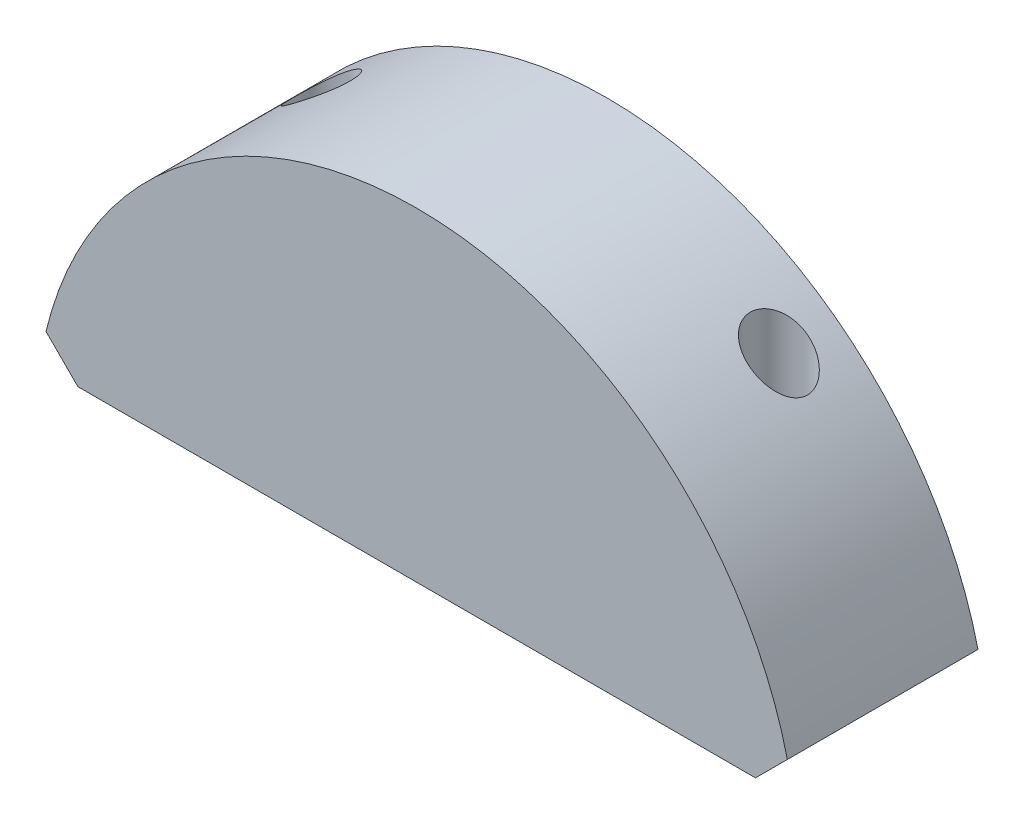
ISO-10303-21;
HEADER;
FILE_DESCRIPTION(('STEP AP214'),'2;1');
FILE_NAME('part.step','',(''),(''),'','','');
FILE_SCHEMA(('AUTOMOTIVE_DESIGN { 1 0 10303 214 1 1 1 1 }'));
ENDSEC;
DATA;
#1=APPLICATION_CONTEXT('core data for automotive mechanical design processes');
#2=APPLICATION_PROTOCOL_DEFINITION('international standard','automotive_design',2000,#1);
#3=PRODUCT_CONTEXT('',#1,'mechanical');
#4=PRODUCT('Part','Part','',(#3));
#5=PRODUCT_RELATED_PRODUCT_CATEGORY('part','',(#4));
#6=PRODUCT_DEFINITION_FORMATION('','',#4);
#7=PRODUCT_DEFINITION_CONTEXT('part definition',#1,'design');
#8=PRODUCT_DEFINITION('design','',#6,#7);
#9=PRODUCT_DEFINITION_SHAPE('','',#8);
#10=(LENGTH_UNIT() NAMED_UNIT(*) SI_UNIT(.MILLI.,.METRE.));
#11=(NAMED_UNIT(*) PLANE_ANGLE_UNIT() SI_UNIT($,.RADIAN.));
#12=(NAMED_UNIT(*) SI_UNIT($,.STERADIAN.) SOLID_ANGLE_UNIT());
#13=UNCERTAINTY_MEASURE_WITH_UNIT(LENGTH_MEASURE(1.E-05),#10,'distance_accuracy_value','');
#14=(GEOMETRIC_REPRESENTATION_CONTEXT(3) GLOBAL_UNCERTAINTY_ASSIGNED_CONTEXT((#13)) GLOBAL_UNIT_ASSIGNED_CONTEXT((#10,
#11,#12)) REPRESENTATION_CONTEXT('',''));
#15=CARTESIAN_POINT('',(0.,0.,0.));
#16=DIRECTION('',(0.,0.,1.));
#17=DIRECTION('',(1.,0.,0.));
#18=AXIS2_PLACEMENT_3D('',#15,#16,#17);
#19=CARTESIAN_POINT('',(-19.4464743814244,4.67275444813921,10.));
#20=DIRECTION('',(0.707106781186549,0.707106781186546,0.));
#21=DIRECTION('',(-0.707106781186546,0.707106781186549,0.));
#22=AXIS2_PLACEMENT_3D('',#19,#20,#21);
#23=PLANE('',#22);
#24=DIRECTION('',(0.707106781186546,-0.707106781186549,0.));
#25=VECTOR('',#24,1.);
#26=CARTESIAN_POINT('',(-19.4464743814244,4.67275444813921,0.));
#27=LINE('',#26,#25);
#28=CARTESIAN_POINT('',(-19.4464743814244,4.67275444813921,0.));
#29=VERTEX_POINT('',#28);
#30=CARTESIAN_POINT('',(-17.7737199332852,3.,0.));
#31=VERTEX_POINT('',#30);
#32=EDGE_CURVE('E101',#29,#31,#27,.T.);
#33=ORIENTED_EDGE('',*,*,#32,.T.);
#34=DIRECTION('',(0.,0.,-1.));
#35=VECTOR('',#34,1.);
#36=CARTESIAN_POINT('',(-17.7737199332852,3.,10.));
#37=LINE('',#36,#35);
#38=CARTESIAN_POINT('',(-17.7737199332852,3.,10.));
#39=VERTEX_POINT('',#38);
#40=EDGE_CURVE('E11',#39,#31,#37,.T.);
#41=ORIENTED_EDGE('',*,*,#40,.F.);
#42=DIRECTION('',(0.707106781186546,-0.707106781186549,0.));
#43=VECTOR('',#42,1.);
#44=CARTESIAN_POINT('',(-19.4464743814244,4.67275444813921,10.));
#45=LINE('',#44,#43);
#46=CARTESIAN_POINT('',(-19.4464743814244,4.67275444813921,10.));
#47=VERTEX_POINT('',#46);
#48=EDGE_CURVE('E88',#47,#39,#45,.T.);
#49=ORIENTED_EDGE('',*,*,#48,.F.);
#50=DIRECTION('',(0.,0.,-1.));
#51=VECTOR('',#50,1.);
#52=CARTESIAN_POINT('',(-19.4464743814244,4.67275444813921,10.));
#53=LINE('',#52,#51);
#54=EDGE_CURVE('E97',#47,#29,#53,.T.);
#55=ORIENTED_EDGE('',*,*,#54,.T.);
#56=EDGE_LOOP('',(#33,#41,#49,#55));
#57=FACE_BOUND('',#56,.T.);
#58=ADVANCED_FACE('F31',(#57),#23,.F.);
#59=CARTESIAN_POINT('',(17.7737199332852,3.,10.));
#60=DIRECTION('',(0.,1.,0.));
#61=DIRECTION('',(0.,0.,1.));
#62=AXIS2_PLACEMENT_3D('',#59,#60,#61);
#63=PLANE('',#62);
#64=CARTESIAN_POINT('',(12.,3.,3.));
#65=DIRECTION('',(0.,-1.,0.));
#66=DIRECTION('',(0.,0.,1.));
#67=AXIS2_PLACEMENT_3D('',#64,#65,#66);
#68=CIRCLE('',#67,1.5);
#69=CARTESIAN_POINT('',(12.,3.,4.5));
#70=VERTEX_POINT('',#69);
#71=EDGE_CURVE('E149',#70,#70,#68,.T.);
#72=ORIENTED_EDGE('',*,*,#71,.F.);
#73=EDGE_LOOP('',(#72));
#74=FACE_BOUND('',#73,.T.);
#75=CARTESIAN_POINT('',(-12.,3.,3.));
#76=DIRECTION('',(0.,-1.,0.));
#77=DIRECTION('',(0.,0.,-1.));
#78=AXIS2_PLACEMENT_3D('',#75,#76,#77);
#79=CIRCLE('',#78,1.5);
#80=CARTESIAN_POINT('',(-12.,3.,1.5));
#81=VERTEX_POINT('',#80);
#82=EDGE_CURVE('E113',#81,#81,#79,.T.);
#83=ORIENTED_EDGE('',*,*,#82,.F.);
#84=EDGE_LOOP('',(#83));
#85=FACE_BOUND('',#84,.T.);
#86=DIRECTION('',(1.,0.,0.));
#87=VECTOR('',#86,1.);
#88=CARTESIAN_POINT('',(17.7737199332852,3.,0.));
#89=LINE('',#88,#87);
#90=CARTESIAN_POINT('',(17.7737199332852,3.,0.));
#91=VERTEX_POINT('',#90);
#92=EDGE_CURVE('E92',#31,#91,#89,.T.);
#93=ORIENTED_EDGE('',*,*,#92,.T.);
#94=DIRECTION('',(0.,0.,-1.));
#95=VECTOR('',#94,1.);
#96=CARTESIAN_POINT('',(17.7737199332852,3.,10.));
#97=LINE('',#96,#95);
#98=CARTESIAN_POINT('',(17.7737199332852,3.,10.));
#99=VERTEX_POINT('',#98);
#100=EDGE_CURVE('E44',#99,#91,#97,.T.);
#101=ORIENTED_EDGE('',*,*,#100,.F.);
#102=DIRECTION('',(1.,0.,0.));
#103=VECTOR('',#102,1.);
#104=CARTESIAN_POINT('',(17.7737199332852,3.,10.));
#105=LINE('',#104,#103);
#106=EDGE_CURVE('E83',#39,#99,#105,.T.);
#107=ORIENTED_EDGE('',*,*,#106,.F.);
#108=ORIENTED_EDGE('',*,*,#40,.T.);
#109=EDGE_LOOP('',(#93,#101,#107,#108));
#110=FACE_BOUND('',#109,.T.);
#111=ADVANCED_FACE('F91',(#74,#85,#110),#63,.F.);
#112=CARTESIAN_POINT('',(19.4464743814244,4.67275444813921,10.));
#113=DIRECTION('',(-0.707106781186549,0.707106781186546,0.));
#114=DIRECTION('',(-0.707106781186546,-0.707106781186549,0.));
#115=AXIS2_PLACEMENT_3D('',#112,#113,#114);
#116=PLANE('',#115);
#117=DIRECTION('',(0.707106781186546,0.707106781186549,0.));
#118=VECTOR('',#117,1.);
#119=CARTESIAN_POINT('',(19.4464743814244,4.67275444813921,0.));
#120=LINE('',#119,#118);
#121=CARTESIAN_POINT('',(19.4464743814244,4.67275444813921,0.));
#122=VERTEX_POINT('',#121);
#123=EDGE_CURVE('E70',#91,#122,#120,.T.);
#124=ORIENTED_EDGE('',*,*,#123,.T.);
#125=DIRECTION('',(0.,0.,-1.));
#126=VECTOR('',#125,1.);
#127=CARTESIAN_POINT('',(19.4464743814244,4.67275444813921,10.));
#128=LINE('',#127,#126);
#129=CARTESIAN_POINT('',(19.4464743814244,4.67275444813921,10.));
#130=VERTEX_POINT('',#129);
#131=EDGE_CURVE('E93',#130,#122,#128,.T.);
#132=ORIENTED_EDGE('',*,*,#131,.F.);
#133=DIRECTION('',(0.707106781186546,0.707106781186549,0.));
#134=VECTOR('',#133,1.);
#135=CARTESIAN_POINT('',(19.4464743814244,4.67275444813921,10.));
#136=LINE('',#135,#134);
#137=EDGE_CURVE('E86',#99,#130,#136,.T.);
#138=ORIENTED_EDGE('',*,*,#137,.F.);
#139=ORIENTED_EDGE('',*,*,#100,.T.);
#140=EDGE_LOOP('',(#124,#132,#138,#139));
#141=FACE_BOUND('',#140,.T.);
#142=ADVANCED_FACE('F95',(#141),#116,.F.);
#143=CARTESIAN_POINT('',(0.,0.,10.));
#144=DIRECTION('',(0.,0.,-1.));
#145=DIRECTION('',(-1.,0.,0.));
#146=AXIS2_PLACEMENT_3D('',#143,#144,#145);
#147=CYLINDRICAL_SURFACE('',#146,20.);
#148=CARTESIAN_POINT('',(12.,16.,1.5));
#149=CARTESIAN_POINT('',(12.1016605629213,15.9237532135887,1.50000004935669));
#150=CARTESIAN_POINT('',(12.2026127311578,15.8465127533473,1.51032097749191));
#151=CARTESIAN_POINT('',(12.400646022508,15.692029679866,1.55095839595559));
#152=CARTESIAN_POINT('',(12.4977205734092,15.6147872679916,1.58130742401025));
#153=CARTESIAN_POINT('',(12.6897064755142,15.4592138939535,1.6636898259232));
#154=CARTESIAN_POINT('',(12.7843139264481,15.3809957521567,1.71665472820429));
#155=CARTESIAN_POINT('',(12.9629089448135,15.2307751019965,1.8446545508195));
#156=CARTESIAN_POINT('',(13.0469231451528,15.1587571563415,1.91963247924919));
#157=CARTESIAN_POINT('',(13.1708907683445,15.0509697154233,2.05968444424559));
#158=CARTESIAN_POINT('',(13.2155595966016,15.0117279077581,2.11794607225101));
#159=CARTESIAN_POINT('',(13.2971797886314,14.9394765813178,2.24310888920046));
#160=CARTESIAN_POINT('',(13.3341434417936,14.9064571463541,2.30999604067372));
#161=CARTESIAN_POINT('',(13.3928015616609,14.8537589270902,2.43942400994441));
#162=CARTESIAN_POINT('',(13.4160296580088,14.8327617291017,2.50072726708063));
#163=CARTESIAN_POINT('',(13.4545746078482,14.7978073911107,2.62770451371876));
#164=CARTESIAN_POINT('',(13.4698962264855,14.7838460108185,2.69337584362389));
#165=CARTESIAN_POINT('',(13.4916421076157,14.7640041775769,2.82778097939976));
#166=CARTESIAN_POINT('',(13.4980169893861,14.7581685755147,2.89652963762857));
#167=CARTESIAN_POINT('',(13.5011884754028,14.755267420131,3.03442992687101));
#168=CARTESIAN_POINT('',(13.4979872687585,14.7581998624203,3.10358146217928));
#169=CARTESIAN_POINT('',(13.4830012003276,14.7718909613274,3.23367914475481));
#170=CARTESIAN_POINT('',(13.472021382519,14.7819154999464,3.2948005649622));
#171=CARTESIAN_POINT('',(13.4430616303673,14.8082569634209,3.41392436688357));
#172=CARTESIAN_POINT('',(13.4250804124258,14.8245750420944,3.47192617444432));
#173=CARTESIAN_POINT('',(13.3816034948475,14.8638351659176,3.58757468259506));
#174=CARTESIAN_POINT('',(13.3556818304176,14.8871505567923,3.64493207249858));
#175=CARTESIAN_POINT('',(13.2980418159378,14.93866067761,3.75426441770425));
#176=CARTESIAN_POINT('',(13.2663196593158,14.9668586110726,3.80623580314361));
#177=CARTESIAN_POINT('',(13.1803316644731,15.0427260154491,3.9301005770873));
#178=CARTESIAN_POINT('',(13.1229220222838,15.0928947956917,3.99829629684761));
#179=CARTESIAN_POINT('',(12.9998708818308,15.1990132172518,4.12155049099019));
#180=CARTESIAN_POINT('',(12.9342108196884,15.2549758433967,4.17657849984266));
#181=CARTESIAN_POINT('',(12.7798704471203,15.384647055898,4.28560543116446));
#182=CARTESIAN_POINT('',(12.6894951910277,15.4593402629862,4.3360376663896));
#183=CARTESIAN_POINT('',(12.5022544047574,15.6111562300716,4.41709380697448));
#184=CARTESIAN_POINT('',(12.4053874483738,15.6882795219658,4.44771334369915));
#185=CARTESIAN_POINT('',(12.2069126063822,15.8432077026678,4.48913684669305));
#186=CARTESIAN_POINT('',(12.1052767364364,15.9210136356196,4.49980331807073));
#187=CARTESIAN_POINT('',(11.9004066568021,16.0747230306896,4.50019129806755));
#188=CARTESIAN_POINT('',(11.7971717440038,16.1506256151288,4.48990331756371));
#189=CARTESIAN_POINT('',(11.5899659066436,16.2999799219,4.44683044842385));
#190=CARTESIAN_POINT('',(11.4860287279132,16.3733410304183,4.41355576711111));
#191=CARTESIAN_POINT('',(11.2842193016896,16.5130665721538,4.32281232383724));
#192=CARTESIAN_POINT('',(11.1863337294807,16.5794466204968,4.26539905840293));
#193=CARTESIAN_POINT('',(11.0315673658264,16.6826343905496,4.14819763134881));
#194=CARTESIAN_POINT('',(10.9715216369123,16.7221477658731,4.09492647133967));
#195=CARTESIAN_POINT('',(10.8591649159862,16.7953271487328,3.97728953681393));
#196=CARTESIAN_POINT('',(10.806849595253,16.8289964305881,3.91293001540785));
#197=CARTESIAN_POINT('',(10.7121014961134,16.8894665285848,3.77360389767993));
#198=CARTESIAN_POINT('',(10.6697416979466,16.9162167589897,3.69856507407423));
#199=CARTESIAN_POINT('',(10.5979555941409,16.9612839160065,3.54019315187877));
#200=CARTESIAN_POINT('',(10.5685197408551,16.979607068653,3.45686623218194));
#201=CARTESIAN_POINT('',(10.5273605290395,17.0051519510712,3.29560140167121));
#202=CARTESIAN_POINT('',(10.5138907603318,17.0134701997499,3.21828040882406));
#203=CARTESIAN_POINT('',(10.4992362845085,17.0225179869444,3.06205860237886));
#204=CARTESIAN_POINT('',(10.4980447598979,17.023251736754,2.9831586898644));
#205=CARTESIAN_POINT('',(10.5076087948478,17.0173493215066,2.8326505627828));
#206=CARTESIAN_POINT('',(10.5174310204263,17.0112889192493,2.76095738189619));
#207=CARTESIAN_POINT('',(10.5470279795145,16.9929544491812,2.62049671268837));
#208=CARTESIAN_POINT('',(10.5668022281685,16.9806806840812,2.55172908201334));
#209=CARTESIAN_POINT('',(10.6156676939691,16.950175007428,2.41796748732423));
#210=CARTESIAN_POINT('',(10.6448759171302,16.9318682092376,2.35303371512348));
#211=CARTESIAN_POINT('',(10.711248859622,16.8899580945463,2.22924846857253));
#212=CARTESIAN_POINT('',(10.748415802057,16.8663532980698,2.17039870048799));
#213=CARTESIAN_POINT('',(10.8329398860586,16.8122022490995,2.05472177457169));
#214=CARTESIAN_POINT('',(10.8809116539043,16.781223570887,1.99854817905675));
#215=CARTESIAN_POINT('',(10.9828767468486,16.7146680692949,1.89512800668807));
#216=CARTESIAN_POINT('',(11.0368729409546,16.679089053808,1.8478857122846));
#217=CARTESIAN_POINT('',(11.1574088396454,16.5987406196212,1.7563920114594));
#218=CARTESIAN_POINT('',(11.2246335533111,16.553386112853,1.71355962226389));
#219=CARTESIAN_POINT('',(11.3627962910017,16.4588542389145,1.63981128319862));
#220=CARTESIAN_POINT('',(11.4337361929509,16.4096749322021,1.60890142717381));
#221=CARTESIAN_POINT('',(11.5867739353569,16.3020390843075,1.55548706424555));
#222=CARTESIAN_POINT('',(11.6691455209899,16.2431971369261,1.53454650227289));
#223=CARTESIAN_POINT('',(11.8345001333518,16.1231224094826,1.50679968712444));
#224=CARTESIAN_POINT('',(11.9174834246622,16.0618885388235,1.4999999599378));
#225=CARTESIAN_POINT('',(12.,16.,1.5));
#226=B_SPLINE_CURVE_WITH_KNOTS('',3,(#148,#149,#150,#151,#152,#153,#154,#155,#156,#157,#158,
#159,#160,#161,#162,#163,#164,#165,#166,#167,#168,#169,#170,#171,#172,#173,#174,#175,#176,#177,
#178,#179,#180,#181,#182,#183,#184,#185,#186,#187,#188,#189,#190,#191,#192,#193,#194,#195,#196,
#197,#198,#199,#200,#201,#202,#203,#204,#205,#206,#207,#208,#209,#210,#211,#212,#213,#214,#215,
#216,#217,#218,#219,#220,#221,#222,#223,#224,#225),.UNSPECIFIED.,.T.,.F.,(4,2,2,2,2,2,2,2,2,2,2,
2,2,2,2,2,2,2,2,2,2,2,2,2,2,2,2,2,2,2,2,2,2,2,2,2,2,2,4),(0.,0.380888747448679,
0.762397816573691,1.16142131309411,1.55942070996349,1.80831992799634,2.0568190736621,
2.26249204307297,2.46804091048419,2.67471988367374,2.88135161332349,3.06923797234161,
3.25715879364833,3.45778881821749,3.65855098185161,3.96373327729259,4.26961497597764,
4.65056330466912,5.03159560261999,5.41524402539658,5.79906622014662,6.19132971875762,
6.5826962617878,6.85005253143594,7.11725852021268,7.38636612164722,7.6552745822342,
7.89076947911889,8.12613361041182,8.34296500964324,8.55978584602022,8.7794063241254,
8.99908822889552,9.23845155373437,9.47792936089045,9.7520175092024,10.0262455643914,
10.3352654956433,10.644428007841),.UNSPECIFIED.);
#227=CARTESIAN_POINT('',(12.,16.,1.5));
#228=VERTEX_POINT('',#227);
#229=EDGE_CURVE('E34',#228,#228,#226,.T.);
#230=ORIENTED_EDGE('',*,*,#229,.T.);
#231=EDGE_LOOP('',(#230));
#232=FACE_BOUND('',#231,.T.);
#233=CARTESIAN_POINT('',(-12.,16.,1.5));
#234=CARTESIAN_POINT('',(-11.8980876048335,16.0764323170644,1.5000003600341));
#235=CARTESIAN_POINT('',(-11.795374042595,16.1519339106007,1.51037246279794));
#236=CARTESIAN_POINT('',(-11.5913536327377,16.2989669800117,1.55298029084801));
#237=CARTESIAN_POINT('',(-11.490048209334,16.3704946286235,1.58523671089141));
#238=CARTESIAN_POINT('',(-11.3142543425323,16.4923175647519,1.66324681195698));
#239=CARTESIAN_POINT('',(-11.238684524381,16.5438706292671,1.70460518809169));
#240=CARTESIAN_POINT('',(-11.0935488275665,16.6415381162207,1.80169184783767));
#241=CARTESIAN_POINT('',(-11.0239734845288,16.6876611556738,1.85739690400877));
#242=CARTESIAN_POINT('',(-10.9036247460083,16.7664950196489,1.9734244783802));
#243=CARTESIAN_POINT('',(-10.8515983746704,16.8001794997242,2.03178224968919));
#244=CARTESIAN_POINT('',(-10.7561004107026,16.8614804890711,2.15799817758912));
#245=CARTESIAN_POINT('',(-10.7126274551483,16.8890979651574,2.22585481765071));
#246=CARTESIAN_POINT('',(-10.6361897009943,16.9373414907645,2.37014029400427));
#247=CARTESIAN_POINT('',(-10.6032891874942,16.9579248158376,2.44661788923494));
#248=CARTESIAN_POINT('',(-10.5503692934813,16.9909003915396,2.60557412620413));
#249=CARTESIAN_POINT('',(-10.5303416713673,17.0032978831174,2.68804889064996));
#250=CARTESIAN_POINT('',(-10.5059450850056,17.0183811355177,2.84666531717342));
#251=CARTESIAN_POINT('',(-10.5000833890813,17.0219930061228,2.92249230541015));
#252=CARTESIAN_POINT('',(-10.4999184896842,17.0220948966151,3.07414954399625));
#253=CARTESIAN_POINT('',(-10.5056110395502,17.0185875331139,3.14997978290739));
#254=CARTESIAN_POINT('',(-10.5276429980599,17.0049664536379,3.29547769185223));
#255=CARTESIAN_POINT('',(-10.5434291725354,16.9951959546369,3.36526304483569));
#256=CARTESIAN_POINT('',(-10.5843294661826,16.969753845377,3.50089488696362));
#257=CARTESIAN_POINT('',(-10.6094442044875,16.9540818434367,3.566741114333));
#258=CARTESIAN_POINT('',(-10.6689917240703,16.9166749481416,3.69543796905904));
#259=CARTESIAN_POINT('',(-10.7037411921448,16.894733040342,3.75808090296772));
#260=CARTESIAN_POINT('',(-10.7806361565001,16.8457697707144,3.87643513553549));
#261=CARTESIAN_POINT('',(-10.822784220928,16.8187466448983,3.9321440157829));
#262=CARTESIAN_POINT('',(-10.9178890891895,16.7571845534856,4.04155760309163));
#263=CARTESIAN_POINT('',(-10.9715220318902,16.7221486702822,4.09439267118534));
#264=CARTESIAN_POINT('',(-11.0841830982763,16.6476860793537,4.1902774291558));
#265=CARTESIAN_POINT('',(-11.1432139512592,16.6082571481853,4.23332213002933));
#266=CARTESIAN_POINT('',(-11.274541163793,16.5194409670355,4.31552589431466));
#267=CARTESIAN_POINT('',(-11.3474700975539,16.4694598846249,4.35303035551361));
#268=CARTESIAN_POINT('',(-11.4962221492973,16.365974093831,4.41517346469698));
#269=CARTESIAN_POINT('',(-11.57204683658,16.3124674631152,4.43980502715793));
#270=CARTESIAN_POINT('',(-11.7381442890676,16.1934588757011,4.47984368956888));
#271=CARTESIAN_POINT('',(-11.8286439442075,16.1274849369142,4.4929128422832));
#272=CARTESIAN_POINT('',(-12.0091013673207,15.9935657699963,4.50269618316554));
#273=CARTESIAN_POINT('',(-12.0990586138851,15.9256189261905,4.49939656809969));
#274=CARTESIAN_POINT('',(-12.2890846402055,15.7795653555701,4.47541502690279));
#275=CARTESIAN_POINT('',(-12.3887946092472,15.7013746346254,4.45235201009592));
#276=CARTESIAN_POINT('',(-12.5825891709098,15.5465051671632,4.38603019746868));
#277=CARTESIAN_POINT('',(-12.6766737297221,15.4698264297345,4.34277128028547));
#278=CARTESIAN_POINT('',(-12.8411398943842,15.3334455836701,4.24499890082287));
#279=CARTESIAN_POINT('',(-12.9128361125113,15.2730688976113,4.1936358138155));
#280=CARTESIAN_POINT('',(-13.0483034816434,15.1574951967083,4.07659138836794));
#281=CARTESIAN_POINT('',(-13.1120862077628,15.1022906462167,4.0109313591837));
#282=CARTESIAN_POINT('',(-13.2148223778713,15.0123937614299,3.8827425817465));
#283=CARTESIAN_POINT('',(-13.2560565832223,14.9759628036903,3.82326569708388));
#284=CARTESIAN_POINT('',(-13.3306489346558,14.9096037748145,3.69625877104046));
#285=CARTESIAN_POINT('',(-13.3640173563308,14.8796672237292,3.62873941171168));
#286=CARTESIAN_POINT('',(-13.4160912652458,14.8327177492785,3.49872011198761));
#287=CARTESIAN_POINT('',(-13.4363251312712,14.8143729529233,3.43731832757045));
#288=CARTESIAN_POINT('',(-13.4688959978802,14.7847668318338,3.31080612958904));
#289=CARTESIAN_POINT('',(-13.4812382565596,14.7735007906854,3.24569821694375));
#290=CARTESIAN_POINT('',(-13.4972125275386,14.7589084124947,3.11323211597964));
#291=CARTESIAN_POINT('',(-13.5008065126064,14.7556167389417,3.04586538928481));
#292=CARTESIAN_POINT('',(-13.498888726625,14.7573711983825,2.91137397683958));
#293=CARTESIAN_POINT('',(-13.4933773865565,14.7624169367433,2.84424927978396));
#294=CARTESIAN_POINT('',(-13.4743664275154,14.7797697752896,2.71698321890953));
#295=CARTESIAN_POINT('',(-13.4614456888825,14.7915505002326,2.65667996533801));
#296=CARTESIAN_POINT('',(-13.4288598155293,14.8211405270667,2.53949536743534));
#297=CARTESIAN_POINT('',(-13.409192016344,14.8389522105928,2.48261538542665));
#298=CARTESIAN_POINT('',(-13.3564790722021,14.886440101642,2.35486471316348));
#299=CARTESIAN_POINT('',(-13.3211599585108,14.9180920605353,2.28566605417657));
#300=CARTESIAN_POINT('',(-13.2422954098062,14.9881420541817,2.15590632220091));
#301=CARTESIAN_POINT('',(-13.1987348329528,15.0265524968956,2.09536151394654));
#302=CARTESIAN_POINT('',(-13.0908551109943,15.1207161398019,1.9660109217337));
#303=CARTESIAN_POINT('',(-13.0242636211823,15.1781786427428,1.90035103105235));
#304=CARTESIAN_POINT('',(-12.8830820444135,15.2981964808271,1.78404266330934));
#305=CARTESIAN_POINT('',(-12.8084817401896,15.3607582963496,1.73341367942219));
#306=CARTESIAN_POINT('',(-12.6519333620279,15.4899672505474,1.64605381787775));
#307=CARTESIAN_POINT('',(-12.5698699134902,15.5566704339982,1.60961485293945));
#308=CARTESIAN_POINT('',(-12.4016331516331,15.6911140433194,1.55204375884532));
#309=CARTESIAN_POINT('',(-12.3154680566121,15.7588522245281,1.53088228976567));
#310=CARTESIAN_POINT('',(-12.1527976286699,15.8845389200665,1.50586275371052));
#311=CARTESIAN_POINT('',(-12.0766252699605,15.9425325357214,1.49999972929976));
#312=CARTESIAN_POINT('',(-12.,16.,1.5));
#313=B_SPLINE_CURVE_WITH_KNOTS('',3,(#233,#234,#235,#236,#237,#238,#239,#240,#241,#242,#243,
#244,#245,#246,#247,#248,#249,#250,#251,#252,#253,#254,#255,#256,#257,#258,#259,#260,#261,#262,
#263,#264,#265,#266,#267,#268,#269,#270,#271,#272,#273,#274,#275,#276,#277,#278,#279,#280,#281,
#282,#283,#284,#285,#286,#287,#288,#289,#290,#291,#292,#293,#294,#295,#296,#297,#298,#299,#300,
#301,#302,#303,#304,#305,#306,#307,#308,#309,#310,#311,#312),.UNSPECIFIED.,.T.,.F.,(4,2,2,2,2,2,
2,2,2,2,2,2,2,2,2,2,2,2,2,2,2,2,2,2,2,2,2,2,2,2,2,2,2,2,2,2,2,2,2,4),(0.,0.381852199418809,
0.764065999032913,1.06407114404965,1.36359359760288,1.6179247857578,1.87221541521554,
2.12802420556192,2.38366905608251,2.61090583488865,2.8380591099448,3.05371988379746,
3.26939497353044,3.49323274921014,3.7171483760326,3.9653010717218,4.21357993985852,
4.50060331369063,4.78778450548272,5.12472758268657,5.46195484098148,5.84664473760215,
6.23133694596236,6.55082545209374,6.86984098854433,7.11205322940871,7.35394727680873,
7.55471734421932,7.75535350083712,7.9568602429058,8.15835744736855,8.34591796191896,
8.5335526309587,8.78385434465488,9.03462047772725,9.36216090756058,9.69012427850932,
10.024516974717,10.3582657600676,10.6453704622747),.UNSPECIFIED.);
#314=CARTESIAN_POINT('',(-12.,16.,1.5));
#315=VERTEX_POINT('',#314);
#316=EDGE_CURVE('E104',#315,#315,#313,.T.);
#317=ORIENTED_EDGE('',*,*,#316,.T.);
#318=EDGE_LOOP('',(#317));
#319=FACE_BOUND('',#318,.T.);
#320=CARTESIAN_POINT('',(0.,0.,0.));
#321=DIRECTION('',(0.,0.,1.));
#322=DIRECTION('',(1.,0.,0.));
#323=AXIS2_PLACEMENT_3D('',#320,#321,#322);
#324=CIRCLE('',#323,20.);
#325=EDGE_CURVE('E76',#122,#29,#324,.T.);
#326=ORIENTED_EDGE('',*,*,#325,.T.);
#327=ORIENTED_EDGE('',*,*,#54,.F.);
#328=CARTESIAN_POINT('',(0.,0.,10.));
#329=DIRECTION('',(0.,0.,1.));
#330=DIRECTION('',(1.,0.,0.));
#331=AXIS2_PLACEMENT_3D('',#328,#329,#330);
#332=CIRCLE('',#331,20.);
#333=EDGE_CURVE('E53',#130,#47,#332,.T.);
#334=ORIENTED_EDGE('',*,*,#333,.F.);
#335=ORIENTED_EDGE('',*,*,#131,.T.);
#336=EDGE_LOOP('',(#326,#327,#334,#335));
#337=FACE_BOUND('',#336,.T.);
#338=ADVANCED_FACE('F114',(#232,#319,#337),#147,.T.);
#339=CARTESIAN_POINT('',(0.,0.,10.));
#340=DIRECTION('',(0.,0.,1.));
#341=DIRECTION('',(1.,0.,0.));
#342=AXIS2_PLACEMENT_3D('',#339,#340,#341);
#343=PLANE('',#342);
#344=ORIENTED_EDGE('',*,*,#48,.T.);
#345=ORIENTED_EDGE('',*,*,#106,.T.);
#346=ORIENTED_EDGE('',*,*,#137,.T.);
#347=ORIENTED_EDGE('',*,*,#333,.T.);
#348=EDGE_LOOP('',(#344,#345,#346,#347));
#349=FACE_BOUND('',#348,.T.);
#350=ADVANCED_FACE('F84',(#349),#343,.T.);
#351=CARTESIAN_POINT('',(0.,0.,0.));
#352=DIRECTION('',(0.,0.,1.));
#353=DIRECTION('',(1.,0.,0.));
#354=AXIS2_PLACEMENT_3D('',#351,#352,#353);
#355=PLANE('',#354);
#356=ORIENTED_EDGE('',*,*,#32,.F.);
#357=ORIENTED_EDGE('',*,*,#325,.F.);
#358=ORIENTED_EDGE('',*,*,#123,.F.);
#359=ORIENTED_EDGE('',*,*,#92,.F.);
#360=EDGE_LOOP('',(#356,#357,#358,#359));
#361=FACE_BOUND('',#360,.T.);
#362=ADVANCED_FACE('F123',(#361),#355,.F.);
#363=CARTESIAN_POINT('',(-12.,20.,3.));
#364=DIRECTION('',(0.,-1.,0.));
#365=DIRECTION('',(0.,0.,-1.));
#366=AXIS2_PLACEMENT_3D('',#363,#364,#365);
#367=CYLINDRICAL_SURFACE('',#366,1.5);
#368=ORIENTED_EDGE('',*,*,#82,.T.);
#369=EDGE_LOOP('',(#368));
#370=FACE_BOUND('',#369,.T.);
#371=ORIENTED_EDGE('',*,*,#316,.F.);
#372=EDGE_LOOP('',(#371));
#373=FACE_BOUND('',#372,.T.);
#374=ADVANCED_FACE('F118',(#370,#373),#367,.F.);
#375=CARTESIAN_POINT('',(12.,20.,3.));
#376=DIRECTION('',(0.,-1.,0.));
#377=DIRECTION('',(0.,0.,-1.));
#378=AXIS2_PLACEMENT_3D('',#375,#376,#377);
#379=CYLINDRICAL_SURFACE('',#378,1.5);
#380=ORIENTED_EDGE('',*,*,#71,.T.);
#381=EDGE_LOOP('',(#380));
#382=FACE_BOUND('',#381,.T.);
#383=ORIENTED_EDGE('',*,*,#229,.F.);
#384=EDGE_LOOP('',(#383));
#385=FACE_BOUND('',#384,.T.);
#386=ADVANCED_FACE('F122',(#382,#385),#379,.F.);
#387=CLOSED_SHELL('',(#58,#111,#142,#338,#350,#362,#374,#386));
#388=MANIFOLD_SOLID_BREP('B2',#387);
#389=ADVANCED_BREP_SHAPE_REPRESENTATION('',(#18,#388),#14);
#390=SHAPE_DEFINITION_REPRESENTATION(#9,#389);
ENDSEC;
END-ISO-10303-21;
